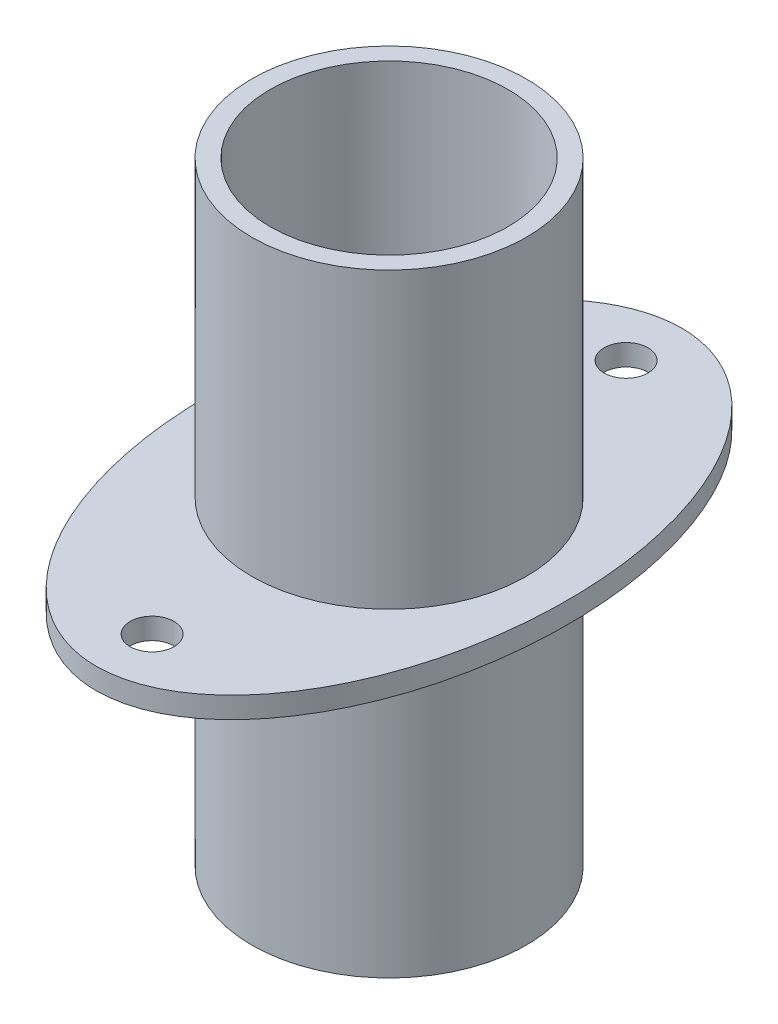
ISO-10303-21;
HEADER;
FILE_DESCRIPTION(('STEP AP214'),'2;1');
FILE_NAME('part.step','',(''),(''),'','','');
FILE_SCHEMA(('AUTOMOTIVE_DESIGN { 1 0 10303 214 1 1 1 1 }'));
ENDSEC;
DATA;
#1=APPLICATION_CONTEXT('core data for automotive mechanical design processes');
#2=APPLICATION_PROTOCOL_DEFINITION('international standard','automotive_design',2000,#1);
#3=PRODUCT_CONTEXT('',#1,'mechanical');
#4=PRODUCT('Part','Part','',(#3));
#5=PRODUCT_RELATED_PRODUCT_CATEGORY('part','',(#4));
#6=PRODUCT_DEFINITION_FORMATION('','',#4);
#7=PRODUCT_DEFINITION_CONTEXT('part definition',#1,'design');
#8=PRODUCT_DEFINITION('design','',#6,#7);
#9=PRODUCT_DEFINITION_SHAPE('','',#8);
#10=(LENGTH_UNIT() NAMED_UNIT(*) SI_UNIT(.MILLI.,.METRE.));
#11=(NAMED_UNIT(*) PLANE_ANGLE_UNIT() SI_UNIT($,.RADIAN.));
#12=(NAMED_UNIT(*) SI_UNIT($,.STERADIAN.) SOLID_ANGLE_UNIT());
#13=UNCERTAINTY_MEASURE_WITH_UNIT(LENGTH_MEASURE(1.E-05),#10,'distance_accuracy_value','');
#14=(GEOMETRIC_REPRESENTATION_CONTEXT(3) GLOBAL_UNCERTAINTY_ASSIGNED_CONTEXT((#13)) GLOBAL_UNIT_ASSIGNED_CONTEXT((#10,
#11,#12)) REPRESENTATION_CONTEXT('',''));
#15=CARTESIAN_POINT('',(0.,0.,0.));
#16=DIRECTION('',(0.,0.,1.));
#17=DIRECTION('',(1.,0.,0.));
#18=AXIS2_PLACEMENT_3D('',#15,#16,#17);
#19=CARTESIAN_POINT('',(0.,0.,0.));
#20=DIRECTION('',(0.,1.,0.));
#21=DIRECTION('',(0.,0.,1.));
#22=AXIS2_PLACEMENT_3D('',#19,#20,#21);
#23=PLANE('',#22);
#24=CARTESIAN_POINT('',(0.,0.,12.95));
#25=DIRECTION('',(0.,1.,0.));
#26=DIRECTION('',(0.,0.,1.));
#27=AXIS2_PLACEMENT_3D('',#24,#25,#26);
#28=CIRCLE('',#27,1.19798712871663);
#29=CARTESIAN_POINT('',(0.,0.,14.1479871287166));
#30=VERTEX_POINT('',#29);
#31=EDGE_CURVE('E54',#30,#30,#28,.T.);
#32=ORIENTED_EDGE('',*,*,#31,.T.);
#33=EDGE_LOOP('',(#32));
#34=FACE_BOUND('',#33,.T.);
#35=CARTESIAN_POINT('',(0.,0.,0.));
#36=DIRECTION('',(0.,1.,0.));
#37=DIRECTION('',(0.,0.,1.));
#38=AXIS2_PLACEMENT_3D('',#35,#36,#37);
#39=ELLIPSE('',#38,16.,9.75);
#40=CARTESIAN_POINT('',(0.,0.,16.));
#41=VERTEX_POINT('',#40);
#42=EDGE_CURVE('E41',#41,#41,#39,.T.);
#43=ORIENTED_EDGE('',*,*,#42,.F.);
#44=EDGE_LOOP('',(#43));
#45=FACE_BOUND('',#44,.T.);
#46=CARTESIAN_POINT('',(0.,0.,-12.95));
#47=DIRECTION('',(0.,1.,0.));
#48=DIRECTION('',(0.,0.,1.));
#49=AXIS2_PLACEMENT_3D('',#46,#47,#48);
#50=CIRCLE('',#49,1.19798712871663);
#51=CARTESIAN_POINT('',(0.,0.,-11.7520128712834));
#52=VERTEX_POINT('',#51);
#53=EDGE_CURVE('E48',#52,#52,#50,.T.);
#54=ORIENTED_EDGE('',*,*,#53,.T.);
#55=EDGE_LOOP('',(#54));
#56=FACE_BOUND('',#55,.T.);
#57=CARTESIAN_POINT('',(0.,0.,0.));
#58=DIRECTION('',(0.,1.,0.));
#59=DIRECTION('',(0.,0.,1.));
#60=AXIS2_PLACEMENT_3D('',#57,#58,#59);
#61=CIRCLE('',#60,7.5);
#62=CARTESIAN_POINT('',(0.,0.,7.5));
#63=VERTEX_POINT('',#62);
#64=EDGE_CURVE('E10',#63,#63,#61,.F.);
#65=ORIENTED_EDGE('',*,*,#64,.F.);
#66=EDGE_LOOP('',(#65));
#67=FACE_BOUND('',#66,.T.);
#68=ADVANCED_FACE('F29',(#34,#45,#56,#67),#23,.F.);
#69=CARTESIAN_POINT('',(0.,1.16,0.));
#70=DIRECTION('',(0.,1.,0.));
#71=DIRECTION('',(0.,0.,1.));
#72=AXIS2_PLACEMENT_3D('',#69,#70,#71);
#73=PLANE('',#72);
#74=CARTESIAN_POINT('',(0.,1.16,12.95));
#75=DIRECTION('',(0.,1.,0.));
#76=DIRECTION('',(0.,0.,1.));
#77=AXIS2_PLACEMENT_3D('',#74,#75,#76);
#78=CIRCLE('',#77,1.19798712871663);
#79=CARTESIAN_POINT('',(0.,1.16,14.1479871287166));
#80=VERTEX_POINT('',#79);
#81=EDGE_CURVE('E51',#80,#80,#78,.T.);
#82=ORIENTED_EDGE('',*,*,#81,.F.);
#83=EDGE_LOOP('',(#82));
#84=FACE_BOUND('',#83,.T.);
#85=CARTESIAN_POINT('',(0.,1.16,0.));
#86=DIRECTION('',(0.,1.,0.));
#87=DIRECTION('',(0.,0.,1.));
#88=AXIS2_PLACEMENT_3D('',#85,#86,#87);
#89=ELLIPSE('',#88,16.,9.75);
#90=CARTESIAN_POINT('',(0.,1.16,16.));
#91=VERTEX_POINT('',#90);
#92=EDGE_CURVE('E37',#91,#91,#89,.T.);
#93=ORIENTED_EDGE('',*,*,#92,.T.);
#94=EDGE_LOOP('',(#93));
#95=FACE_BOUND('',#94,.T.);
#96=CARTESIAN_POINT('',(0.,1.16,-12.95));
#97=DIRECTION('',(0.,1.,0.));
#98=DIRECTION('',(0.,0.,1.));
#99=AXIS2_PLACEMENT_3D('',#96,#97,#98);
#100=CIRCLE('',#99,1.19798712871663);
#101=CARTESIAN_POINT('',(0.,1.16,-11.7520128712834));
#102=VERTEX_POINT('',#101);
#103=EDGE_CURVE('E45',#102,#102,#100,.T.);
#104=ORIENTED_EDGE('',*,*,#103,.F.);
#105=EDGE_LOOP('',(#104));
#106=FACE_BOUND('',#105,.T.);
#107=CARTESIAN_POINT('',(0.,1.16,0.));
#108=DIRECTION('',(0.,1.,0.));
#109=DIRECTION('',(0.,0.,1.));
#110=AXIS2_PLACEMENT_3D('',#107,#108,#109);
#111=CIRCLE('',#110,7.5);
#112=CARTESIAN_POINT('',(0.,1.16,7.5));
#113=VERTEX_POINT('',#112);
#114=EDGE_CURVE('E60',#113,#113,#111,.T.);
#115=ORIENTED_EDGE('',*,*,#114,.F.);
#116=EDGE_LOOP('',(#115));
#117=FACE_BOUND('',#116,.T.);
#118=ADVANCED_FACE('F88',(#84,#95,#106,#117),#73,.T.);
#119=DIRECTION('',(0.,-1.,0.));
#120=VECTOR('',#119,1.);
#121=SURFACE_OF_LINEAR_EXTRUSION('',#89,#120);
#122=ORIENTED_EDGE('',*,*,#92,.F.);
#123=EDGE_LOOP('',(#122));
#124=FACE_BOUND('',#123,.T.);
#125=ORIENTED_EDGE('',*,*,#42,.T.);
#126=EDGE_LOOP('',(#125));
#127=FACE_BOUND('',#126,.T.);
#128=ADVANCED_FACE('F31',(#124,#127),#121,.F.);
#129=CARTESIAN_POINT('',(0.,1.16,-12.95));
#130=DIRECTION('',(0.,-1.,0.));
#131=DIRECTION('',(0.,0.,-1.));
#132=AXIS2_PLACEMENT_3D('',#129,#130,#131);
#133=CYLINDRICAL_SURFACE('',#132,1.19798712871663);
#134=ORIENTED_EDGE('',*,*,#103,.T.);
#135=EDGE_LOOP('',(#134));
#136=FACE_BOUND('',#135,.T.);
#137=ORIENTED_EDGE('',*,*,#53,.F.);
#138=EDGE_LOOP('',(#137));
#139=FACE_BOUND('',#138,.T.);
#140=ADVANCED_FACE('F97',(#136,#139),#133,.F.);
#141=CARTESIAN_POINT('',(0.,1.16,12.95));
#142=DIRECTION('',(0.,-1.,0.));
#143=DIRECTION('',(0.,0.,-1.));
#144=AXIS2_PLACEMENT_3D('',#141,#142,#143);
#145=CYLINDRICAL_SURFACE('',#144,1.19798712871663);
#146=ORIENTED_EDGE('',*,*,#81,.T.);
#147=EDGE_LOOP('',(#146));
#148=FACE_BOUND('',#147,.T.);
#149=ORIENTED_EDGE('',*,*,#31,.F.);
#150=EDGE_LOOP('',(#149));
#151=FACE_BOUND('',#150,.T.);
#152=ADVANCED_FACE('F100',(#148,#151),#145,.F.);
#153=CARTESIAN_POINT('',(0.,17.21,0.));
#154=DIRECTION('',(0.,-1.,0.));
#155=DIRECTION('',(0.,0.,-1.));
#156=AXIS2_PLACEMENT_3D('',#153,#154,#155);
#157=CYLINDRICAL_SURFACE('',#156,7.5);
#158=CARTESIAN_POINT('',(0.,17.21,0.));
#159=DIRECTION('',(0.,1.,0.));
#160=DIRECTION('',(0.,0.,1.));
#161=AXIS2_PLACEMENT_3D('',#158,#159,#160);
#162=CIRCLE('',#161,7.5);
#163=CARTESIAN_POINT('',(0.,17.21,7.5));
#164=VERTEX_POINT('',#163);
#165=EDGE_CURVE('E57',#164,#164,#162,.T.);
#166=ORIENTED_EDGE('',*,*,#165,.F.);
#167=EDGE_LOOP('',(#166));
#168=FACE_BOUND('',#167,.T.);
#169=ORIENTED_EDGE('',*,*,#114,.T.);
#170=EDGE_LOOP('',(#169));
#171=FACE_BOUND('',#170,.T.);
#172=ADVANCED_FACE('F104',(#168,#171),#157,.T.);
#173=CARTESIAN_POINT('',(0.,17.21,0.));
#174=DIRECTION('',(0.,1.,0.));
#175=DIRECTION('',(0.,0.,1.));
#176=AXIS2_PLACEMENT_3D('',#173,#174,#175);
#177=PLANE('',#176);
#178=CARTESIAN_POINT('',(0.,17.21,0.));
#179=DIRECTION('',(0.,1.,0.));
#180=DIRECTION('',(0.,0.,1.));
#181=AXIS2_PLACEMENT_3D('',#178,#179,#180);
#182=CIRCLE('',#181,6.5);
#183=CARTESIAN_POINT('',(0.,17.21,6.5));
#184=VERTEX_POINT('',#183);
#185=EDGE_CURVE('E68',#184,#184,#182,.T.);
#186=ORIENTED_EDGE('',*,*,#185,.F.);
#187=EDGE_LOOP('',(#186));
#188=FACE_BOUND('',#187,.T.);
#189=ORIENTED_EDGE('',*,*,#165,.T.);
#190=EDGE_LOOP('',(#189));
#191=FACE_BOUND('',#190,.T.);
#192=ADVANCED_FACE('F108',(#188,#191),#177,.T.);
#193=CARTESIAN_POINT('',(0.,-16.29,0.));
#194=DIRECTION('',(0.,1.,0.));
#195=DIRECTION('',(0.,0.,1.));
#196=AXIS2_PLACEMENT_3D('',#193,#194,#195);
#197=CYLINDRICAL_SURFACE('',#196,7.5);
#198=CARTESIAN_POINT('',(0.,-16.29,0.));
#199=DIRECTION('',(0.,-1.,0.));
#200=DIRECTION('',(0.,0.,-1.));
#201=AXIS2_PLACEMENT_3D('',#198,#199,#200);
#202=CIRCLE('',#201,7.5);
#203=CARTESIAN_POINT('',(0.,-16.29,-7.5));
#204=VERTEX_POINT('',#203);
#205=EDGE_CURVE('E63',#204,#204,#202,.T.);
#206=ORIENTED_EDGE('',*,*,#205,.F.);
#207=EDGE_LOOP('',(#206));
#208=FACE_BOUND('',#207,.T.);
#209=ORIENTED_EDGE('',*,*,#64,.T.);
#210=EDGE_LOOP('',(#209));
#211=FACE_BOUND('',#210,.T.);
#212=ADVANCED_FACE('F112',(#208,#211),#197,.T.);
#213=CARTESIAN_POINT('',(0.,-16.29,0.));
#214=DIRECTION('',(0.,-1.,0.));
#215=DIRECTION('',(0.,0.,-1.));
#216=AXIS2_PLACEMENT_3D('',#213,#214,#215);
#217=PLANE('',#216);
#218=ORIENTED_EDGE('',*,*,#205,.T.);
#219=EDGE_LOOP('',(#218));
#220=FACE_BOUND('',#219,.T.);
#221=ADVANCED_FACE('F83',(#220),#217,.T.);
#222=CARTESIAN_POINT('',(0.,-16.29,0.));
#223=DIRECTION('',(0.,1.,0.));
#224=DIRECTION('',(0.,0.,1.));
#225=AXIS2_PLACEMENT_3D('',#222,#223,#224);
#226=CYLINDRICAL_SURFACE('',#225,6.5);
#227=ORIENTED_EDGE('',*,*,#185,.T.);
#228=EDGE_LOOP('',(#227));
#229=FACE_BOUND('',#228,.T.);
#230=CARTESIAN_POINT('',(0.,-15.29,0.));
#231=DIRECTION('',(0.,-1.,0.));
#232=DIRECTION('',(0.,0.,-1.));
#233=AXIS2_PLACEMENT_3D('',#230,#231,#232);
#234=CIRCLE('',#233,6.5);
#235=CARTESIAN_POINT('',(0.,-15.29,-6.5));
#236=VERTEX_POINT('',#235);
#237=EDGE_CURVE('E71',#236,#236,#234,.T.);
#238=ORIENTED_EDGE('',*,*,#237,.T.);
#239=EDGE_LOOP('',(#238));
#240=FACE_BOUND('',#239,.T.);
#241=ADVANCED_FACE('F75',(#229,#240),#226,.F.);
#242=CARTESIAN_POINT('',(0.,-15.29,0.));
#243=DIRECTION('',(0.,-1.,0.));
#244=DIRECTION('',(0.,0.,-1.));
#245=AXIS2_PLACEMENT_3D('',#242,#243,#244);
#246=PLANE('',#245);
#247=ORIENTED_EDGE('',*,*,#237,.F.);
#248=EDGE_LOOP('',(#247));
#249=FACE_BOUND('',#248,.T.);
#250=ADVANCED_FACE('F77',(#249),#246,.F.);
#251=CLOSED_SHELL('',(#68,#118,#128,#140,#152,#172,#192,#212,#221,#241,#250));
#252=MANIFOLD_SOLID_BREP('B2',#251);
#253=ADVANCED_BREP_SHAPE_REPRESENTATION('',(#18,#252),#14);
#254=SHAPE_DEFINITION_REPRESENTATION(#9,#253);
ENDSEC;
END-ISO-10303-21;
